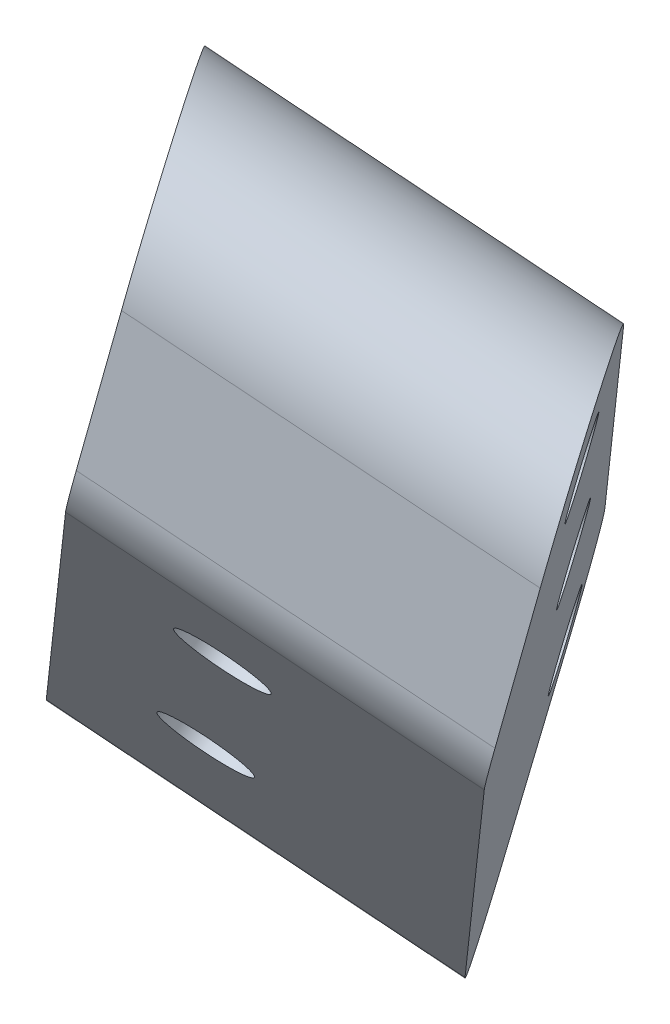
ISO-10303-21;
HEADER;
FILE_DESCRIPTION(('STEP AP214'),'2;1');
FILE_NAME('part.step','',(''),(''),'','','');
FILE_SCHEMA(('AUTOMOTIVE_DESIGN { 1 0 10303 214 1 1 1 1 }'));
ENDSEC;
DATA;
#1=APPLICATION_CONTEXT('core data for automotive mechanical design processes');
#2=APPLICATION_PROTOCOL_DEFINITION('international standard','automotive_design',2000,#1);
#3=PRODUCT_CONTEXT('',#1,'mechanical');
#4=PRODUCT('Part','Part','',(#3));
#5=PRODUCT_RELATED_PRODUCT_CATEGORY('part','',(#4));
#6=PRODUCT_DEFINITION_FORMATION('','',#4);
#7=PRODUCT_DEFINITION_CONTEXT('part definition',#1,'design');
#8=PRODUCT_DEFINITION('design','',#6,#7);
#9=PRODUCT_DEFINITION_SHAPE('','',#8);
#10=(LENGTH_UNIT() NAMED_UNIT(*) SI_UNIT(.MILLI.,.METRE.));
#11=(NAMED_UNIT(*) PLANE_ANGLE_UNIT() SI_UNIT($,.RADIAN.));
#12=(NAMED_UNIT(*) SI_UNIT($,.STERADIAN.) SOLID_ANGLE_UNIT());
#13=UNCERTAINTY_MEASURE_WITH_UNIT(LENGTH_MEASURE(1.E-05),#10,'distance_accuracy_value','');
#14=(GEOMETRIC_REPRESENTATION_CONTEXT(3) GLOBAL_UNCERTAINTY_ASSIGNED_CONTEXT((#13)) GLOBAL_UNIT_ASSIGNED_CONTEXT((#10,
#11,#12)) REPRESENTATION_CONTEXT('',''));
#15=CARTESIAN_POINT('',(0.,0.,0.));
#16=DIRECTION('',(0.,0.,1.));
#17=DIRECTION('',(1.,0.,0.));
#18=AXIS2_PLACEMENT_3D('',#15,#16,#17);
#19=CARTESIAN_POINT('',(185.976617276051,-86.2944774117005,110.115625331881));
#20=DIRECTION('',(-0.525823202782472,-0.503496874959795,-0.685566084576319));
#21=DIRECTION('',(0.84192618120736,-0.422850574318319,-0.335197997005144));
#22=AXIS2_PLACEMENT_3D('',#19,#20,#21);
#23=PLANE('',#22);
#24=DIRECTION('',(0.12292222881103,-0.842504955736532,0.52447642961673));
#25=VECTOR('',#24,1.);
#26=CARTESIAN_POINT('',(185.976617276051,-86.2944774117005,110.115625331881));
#27=LINE('',#26,#25);
#28=CARTESIAN_POINT('',(187.202208795844,-94.6946418011882,115.344898106117));
#29=VERTEX_POINT('',#28);
#30=CARTESIAN_POINT('',(188.014618086983,-100.262868642591,118.811232295833));
#31=VERTEX_POINT('',#30);
#32=EDGE_CURVE('E105',#29,#31,#27,.T.);
#33=ORIENTED_EDGE('',*,*,#32,.F.);
#34=DIRECTION('',(0.841926181207359,-0.422850574318319,-0.335197997005144));
#35=VECTOR('',#34,1.);
#36=CARTESIAN_POINT('',(184.818690380374,-93.4975390701214,116.293853746794));
#37=LINE('',#36,#35);
#38=CARTESIAN_POINT('',(199.832260071021,-101.03798229182,110.316466892068));
#39=VERTEX_POINT('',#38);
#40=EDGE_CURVE('E157',#29,#39,#37,.T.);
#41=ORIENTED_EDGE('',*,*,#40,.T.);
#42=DIRECTION('',(-0.122922228811031,0.842504955736533,-0.524476429616729));
#43=VECTOR('',#42,1.);
#44=CARTESIAN_POINT('',(201.275744144693,-110.931575154228,116.475429192796));
#45=LINE('',#44,#43);
#46=CARTESIAN_POINT('',(200.644669362159,-106.606209133222,113.782801081784));
#47=VERTEX_POINT('',#46);
#48=EDGE_CURVE('E124',#47,#39,#45,.T.);
#49=ORIENTED_EDGE('',*,*,#48,.F.);
#50=DIRECTION('',(0.841926181207359,-0.422850574318319,-0.335197997005144));
#51=VECTOR('',#50,1.);
#52=CARTESIAN_POINT('',(184.051134018149,-98.272241017251,120.389223277334));
#53=LINE('',#52,#51);
#54=EDGE_CURVE('E122',#47,#31,#53,.F.);
#55=ORIENTED_EDGE('',*,*,#54,.T.);
#56=EDGE_LOOP('',(#33,#41,#49,#55));
#57=FACE_BOUND('',#56,.T.);
#58=ADVANCED_FACE('F41',(#57),#23,.T.);
#59=CARTESIAN_POINT('',(213.598784000708,-71.3473521679495,145.102749077753));
#60=DIRECTION('',(0.404198114358015,0.0826871389079361,0.910926298560232));
#61=DIRECTION('',(-0.84192618120736,0.422850574318318,0.335197997005144));
#62=AXIS2_PLACEMENT_3D('',#59,#60,#61);
#63=PLANE('',#62);
#64=DIRECTION('',(-0.158999682000957,-0.97439119569462,0.158999682000952));
#65=VECTOR('',#64,1.);
#66=CARTESIAN_POINT('',(226.765173325175,-74.4038743041625,139.537979814407));
#67=LINE('',#66,#65);
#68=CARTESIAN_POINT('',(227.396164309813,-70.5369982685889,138.90698882977));
#69=VERTEX_POINT('',#68);
#70=CARTESIAN_POINT('',(226.442486068137,-76.381385317167,139.860667071446));
#71=VERTEX_POINT('',#70);
#72=EDGE_CURVE('E190',#69,#71,#67,.T.);
#73=ORIENTED_EDGE('',*,*,#72,.F.);
#74=DIRECTION('',(-0.841926181207359,0.422850574318319,0.335197997005144));
#75=VECTOR('',#74,1.);
#76=CARTESIAN_POINT('',(216.156009019091,-64.8917217274877,143.382057575196));
#77=LINE('',#76,#75);
#78=CARTESIAN_POINT('',(214.766113034639,-64.1936577779554,143.935420043822));
#79=VERTEX_POINT('',#78);
#80=EDGE_CURVE('E11',#69,#79,#77,.T.);
#81=ORIENTED_EDGE('',*,*,#80,.T.);
#82=DIRECTION('',(0.158999682000957,0.97439119569462,-0.158999682000953));
#83=VECTOR('',#82,1.);
#84=CARTESIAN_POINT('',(213.598784000708,-71.3473521679495,145.102749077753));
#85=LINE('',#84,#83);
#86=CARTESIAN_POINT('',(213.812434792963,-70.0380448265335,144.889098285497));
#87=VERTEX_POINT('',#86);
#88=EDGE_CURVE('E197',#87,#79,#85,.T.);
#89=ORIENTED_EDGE('',*,*,#88,.F.);
#90=DIRECTION('',(0.841926181207359,-0.422850574318319,-0.335197997005144));
#91=VECTOR('',#90,1.);
#92=CARTESIAN_POINT('',(214.066820976806,-70.1658082175974,144.787818932042));
#93=LINE('',#92,#91);
#94=EDGE_CURVE('E140',#87,#71,#93,.T.);
#95=ORIENTED_EDGE('',*,*,#94,.T.);
#96=EDGE_LOOP('',(#73,#81,#89,#95));
#97=FACE_BOUND('',#96,.T.);
#98=ADVANCED_FACE('F235',(#97),#63,.T.);
#99=CARTESIAN_POINT('',(88.6800986061576,-24.2076389183273,-59.6705769029359));
#100=DIRECTION('',(0.809172566386445,-0.220885605875267,-0.544471585048009));
#101=DIRECTION('',(0.558260781142676,0.,0.829665535163399));
#102=AXIS2_PLACEMENT_3D('',#99,#100,#101);
#103=PLANE('',#102);
#104=CARTESIAN_POINT('',(190.488893618727,-95.0744781125999,120.383536746134));
#105=DIRECTION('',(0.809172566386444,-0.220885605875265,-0.54447158504801));
#106=DIRECTION('',(-0.558260781142677,0.,-0.829665535163398));
#107=AXIS2_PLACEMENT_3D('',#104,#105,#106);
#108=CIRCLE('',#107,1.75000000000021);
#109=CARTESIAN_POINT('',(189.511937251727,-95.0744781125999,118.931622059598));
#110=VERTEX_POINT('',#109);
#111=EDGE_CURVE('E118',#110,#110,#108,.T.);
#112=ORIENTED_EDGE('',*,*,#111,.T.);
#113=EDGE_LOOP('',(#112));
#114=FACE_BOUND('',#113,.T.);
#115=CARTESIAN_POINT('',(201.068795197788,-81.5306176833387,130.6123943192));
#116=DIRECTION('',(0.809172566386444,-0.220885605875265,-0.54447158504801));
#117=DIRECTION('',(-0.558260781142677,0.,-0.829665535163398));
#118=AXIS2_PLACEMENT_3D('',#115,#116,#117);
#119=CIRCLE('',#118,1.75000000000027);
#120=CARTESIAN_POINT('',(200.091838830788,-81.5306176833387,129.160479632664));
#121=VERTEX_POINT('',#120);
#122=EDGE_CURVE('E364',#121,#121,#119,.T.);
#123=ORIENTED_EDGE('',*,*,#122,.T.);
#124=EDGE_LOOP('',(#123));
#125=FACE_BOUND('',#124,.T.);
#126=CARTESIAN_POINT('',(211.648696776849,-67.9867572540774,140.841251892266));
#127=DIRECTION('',(0.809172566386444,-0.220885605875265,-0.54447158504801));
#128=DIRECTION('',(-0.558260781142677,0.,-0.829665535163398));
#129=AXIS2_PLACEMENT_3D('',#126,#127,#128);
#130=CIRCLE('',#129,1.75000000000024);
#131=CARTESIAN_POINT('',(210.671740409849,-67.9867572540774,139.38933720573));
#132=VERTEX_POINT('',#131);
#133=EDGE_CURVE('E205',#132,#132,#130,.T.);
#134=ORIENTED_EDGE('',*,*,#133,.T.);
#135=EDGE_LOOP('',(#134));
#136=FACE_BOUND('',#135,.T.);
#137=DIRECTION('',(0.527989065999957,0.679937623467727,0.508834329008521));
#138=VECTOR('',#137,1.);
#139=CARTESIAN_POINT('',(137.008875950495,-155.279449206516,65.3280435791776));
#140=LINE('',#139,#138);
#141=CARTESIAN_POINT('',(188.755013198871,-88.6414298799968,115.196900192133));
#142=VERTEX_POINT('',#141);
#143=CARTESIAN_POINT('',(210.586127898886,-60.5275972219907,136.23601125564));
#144=VERTEX_POINT('',#143);
#145=EDGE_CURVE('E179',#142,#144,#140,.T.);
#146=ORIENTED_EDGE('',*,*,#145,.F.);
#147=CARTESIAN_POINT('',(190.090827290536,-92.3074904359615,118.669412212537));
#148=DIRECTION('',(0.809172566386445,-0.220885605875267,-0.544471585048009));
#149=DIRECTION('',(0.232829945707228,-0.730253036622379,0.642277758361415));
#150=AXIS2_PLACEMENT_3D('',#147,#148,#149);
#151=ELLIPSE('',#150,5.22372722873458,5.);
#152=EDGE_CURVE('E50',#142,#29,#151,.F.);
#153=ORIENTED_EDGE('',*,*,#152,.T.);
#154=ORIENTED_EDGE('',*,*,#32,.T.);
#155=CARTESIAN_POINT('',(189.747789183798,-98.8305778234545,120.805940759685));
#156=DIRECTION('',(0.809172566386445,-0.220885605875267,-0.544471585048009));
#157=DIRECTION('',(0.232829945707228,-0.730253036622379,0.642277758361415));
#158=AXIS2_PLACEMENT_3D('',#155,#156,#157);
#159=ELLIPSE('',#158,3.13423633724075,3.);
#160=CARTESIAN_POINT('',(190.549277638797,-101.030214157033,122.889447971927));
#161=VERTEX_POINT('',#160);
#162=EDGE_CURVE('E110',#31,#161,#159,.F.);
#163=ORIENTED_EDGE('',*,*,#162,.T.);
#164=DIRECTION('',(0.527989065999957,0.679937623467728,0.508834329008521));
#165=VECTOR('',#164,1.);
#166=CARTESIAN_POINT('',(188.509775218846,-103.656659509367,120.923935971406));
#167=LINE('',#166,#165);
#168=CARTESIAN_POINT('',(212.907420621509,-72.2376811601123,144.436467437073));
#169=VERTEX_POINT('',#168);
#170=EDGE_CURVE('E117',#161,#169,#167,.T.);
#171=ORIENTED_EDGE('',*,*,#170,.T.);
#172=CARTESIAN_POINT('',(212.10593216651,-70.0380448265335,142.352960224831));
#173=DIRECTION('',(0.809172566386445,-0.220885605875267,-0.544471585048009));
#174=DIRECTION('',(0.232829945707228,-0.730253036622379,0.642277758361415));
#175=AXIS2_PLACEMENT_3D('',#172,#173,#174);
#176=ELLIPSE('',#175,3.13423633724075,3.);
#177=EDGE_CURVE('E135',#169,#87,#176,.F.);
#178=ORIENTED_EDGE('',*,*,#177,.T.);
#179=ORIENTED_EDGE('',*,*,#88,.T.);
#180=CARTESIAN_POINT('',(211.921941990551,-64.1936577779554,139.708523276044));
#181=DIRECTION('',(0.809172566386445,-0.220885605875267,-0.544471585048009));
#182=DIRECTION('',(-0.232829945707228,0.730253036622379,-0.642277758361415));
#183=AXIS2_PLACEMENT_3D('',#180,#181,#182);
#184=ELLIPSE('',#183,5.22372722873458,5.);
#185=EDGE_CURVE('E57',#79,#144,#184,.F.);
#186=ORIENTED_EDGE('',*,*,#185,.T.);
#187=EDGE_LOOP('',(#146,#153,#154,#163,#171,#178,#179,#186));
#188=FACE_BOUND('',#187,.T.);
#189=ADVANCED_FACE('F107',(#114,#125,#136,#188),#103,.F.);
#190=CARTESIAN_POINT('',(211.253028266815,-11.6412960040825,46.2298565024584));
#191=DIRECTION('',(0.0127540111486141,-0.605437357739748,0.7957907646189));
#192=DIRECTION('',(-0.932864874414854,-0.293736319493059,-0.208523621428438));
#193=AXIS2_PLACEMENT_3D('',#190,#191,#192);
#194=CYLINDRICAL_SURFACE('',#193,1.74999999999995);
#195=CARTESIAN_POINT('',(212.717958189311,-81.1820303828364,137.634645909617));
#196=DIRECTION('',(-0.0127540111486141,0.605437357739748,-0.7957907646189));
#197=DIRECTION('',(-0.932864874414854,-0.293736319493059,-0.208523621428438));
#198=AXIS2_PLACEMENT_3D('',#195,#196,#197);
#199=CIRCLE('',#198,1.74999999999995);
#200=CARTESIAN_POINT('',(211.085444659085,-81.6960689419492,137.269729572117));
#201=VERTEX_POINT('',#200);
#202=EDGE_CURVE('E206',#201,#201,#199,.T.);
#203=ORIENTED_EDGE('',*,*,#202,.F.);
#204=EDGE_LOOP('',(#203));
#205=FACE_BOUND('',#204,.T.);
#206=CARTESIAN_POINT('',(212.543927470561,-72.9207314630371,126.775941371338));
#207=DIRECTION('',(-0.0127540111486136,0.605437357739749,-0.7957907646189));
#208=DIRECTION('',(0.,0.79585549608909,0.605486605421448));
#209=AXIS2_PLACEMENT_3D('',#206,#207,#208);
#210=CIRCLE('',#209,1.74999999999995);
#211=CARTESIAN_POINT('',(212.543927470561,-71.5279843448812,127.835542930826));
#212=VERTEX_POINT('',#211);
#213=EDGE_CURVE('E377',#212,#212,#210,.F.);
#214=ORIENTED_EDGE('',*,*,#213,.F.);
#215=EDGE_LOOP('',(#214));
#216=FACE_BOUND('',#215,.T.);
#217=ADVANCED_FACE('F244',(#205,#216),#194,.F.);
#218=CARTESIAN_POINT('',(200.46418883716,-25.1267399738119,36.1430460699975));
#219=DIRECTION('',(0.0127540111486141,-0.605437357739748,0.7957907646189));
#220=DIRECTION('',(-0.932864874414854,-0.293736319493059,-0.208523621428438));
#221=AXIS2_PLACEMENT_3D('',#218,#219,#220);
#222=CYLINDRICAL_SURFACE('',#221,1.7499999999999);
#223=CARTESIAN_POINT('',(201.929118759655,-94.6674743525658,127.547835477156));
#224=DIRECTION('',(-0.0127540111486141,0.605437357739748,-0.7957907646189));
#225=DIRECTION('',(-0.932864874414854,-0.293736319493059,-0.208523621428438));
#226=AXIS2_PLACEMENT_3D('',#223,#224,#225);
#227=CIRCLE('',#226,1.7499999999999);
#228=CARTESIAN_POINT('',(200.296605229429,-95.1815129116786,127.182919139657));
#229=VERTEX_POINT('',#228);
#230=EDGE_CURVE('E373',#229,#229,#227,.T.);
#231=ORIENTED_EDGE('',*,*,#230,.F.);
#232=EDGE_LOOP('',(#231));
#233=FACE_BOUND('',#232,.T.);
#234=CARTESIAN_POINT('',(201.755088040906,-86.4061754327664,116.689130938877));
#235=DIRECTION('',(-0.0127540111486136,0.605437357739749,-0.7957907646189));
#236=DIRECTION('',(0.,0.79585549608909,0.605486605421448));
#237=AXIS2_PLACEMENT_3D('',#234,#235,#236);
#238=CIRCLE('',#237,1.7499999999999);
#239=CARTESIAN_POINT('',(201.755088040906,-85.0134283146106,117.748732498365));
#240=VERTEX_POINT('',#239);
#241=EDGE_CURVE('E182',#240,#240,#238,.F.);
#242=ORIENTED_EDGE('',*,*,#241,.F.);
#243=EDGE_LOOP('',(#242));
#244=FACE_BOUND('',#243,.T.);
#245=ADVANCED_FACE('F247',(#233,#244),#222,.F.);
#246=CARTESIAN_POINT('',(231.07971496456,-47.9632466628545,135.223438175022));
#247=DIRECTION('',(0.809172566386446,-0.220885605875289,-0.544471585047998));
#248=DIRECTION('',(-0.558260781142668,0.,-0.829665535163404));
#249=AXIS2_PLACEMENT_3D('',#246,#247,#248);
#250=PLANE('',#249);
#251=CARTESIAN_POINT('',(223.267509790784,-71.1584274993941,133.023248908892));
#252=DIRECTION('',(0.809172566386446,-0.220885605875289,-0.544471585047998));
#253=DIRECTION('',(-0.558260781142668,0.,-0.829665535163404));
#254=AXIS2_PLACEMENT_3D('',#251,#252,#253);
#255=CIRCLE('',#254,1.75000000000024);
#256=CARTESIAN_POINT('',(222.290553423784,-71.1584274993941,131.571334222356));
#257=VERTEX_POINT('',#256);
#258=EDGE_CURVE('E189',#257,#257,#255,.F.);
#259=ORIENTED_EDGE('',*,*,#258,.T.);
#260=EDGE_LOOP('',(#259));
#261=FACE_BOUND('',#260,.T.);
#262=CARTESIAN_POINT('',(212.687608211723,-84.7022879286554,122.794391335826));
#263=DIRECTION('',(0.809172566386446,-0.220885605875289,-0.544471585047998));
#264=DIRECTION('',(-0.558260781142668,0.,-0.829665535163404));
#265=AXIS2_PLACEMENT_3D('',#262,#263,#264);
#266=CIRCLE('',#265,1.75000000000027);
#267=CARTESIAN_POINT('',(211.710651844723,-84.7022879286554,121.34247664929));
#268=VERTEX_POINT('',#267);
#269=EDGE_CURVE('E195',#268,#268,#266,.F.);
#270=ORIENTED_EDGE('',*,*,#269,.T.);
#271=EDGE_LOOP('',(#270));
#272=FACE_BOUND('',#271,.T.);
#273=CARTESIAN_POINT('',(202.107706632661,-98.2461483579165,112.56553376276));
#274=DIRECTION('',(0.809172566386446,-0.220885605875289,-0.544471585047998));
#275=DIRECTION('',(-0.558260781142668,0.,-0.829665535163404));
#276=AXIS2_PLACEMENT_3D('',#273,#274,#275);
#277=CIRCLE('',#276,1.75000000000021);
#278=CARTESIAN_POINT('',(201.130750265662,-98.2461483579165,111.113619076224));
#279=VERTEX_POINT('',#278);
#280=EDGE_CURVE('E128',#279,#279,#277,.F.);
#281=ORIENTED_EDGE('',*,*,#280,.T.);
#282=EDGE_LOOP('',(#281));
#283=FACE_BOUND('',#282,.T.);
#284=ORIENTED_EDGE('',*,*,#48,.T.);
#285=CARTESIAN_POINT('',(202.72087856571,-98.650830926595,113.640980998485));
#286=DIRECTION('',(0.809172566386446,-0.220885605875289,-0.544471585047998));
#287=DIRECTION('',(0.232829945707224,-0.730253036622356,0.642277758361442));
#288=AXIS2_PLACEMENT_3D('',#285,#286,#287);
#289=ELLIPSE('',#288,5.22372722873454,5.);
#290=CARTESIAN_POINT('',(201.385064474045,-94.9847703706304,110.168468978082));
#291=VERTEX_POINT('',#290);
#292=EDGE_CURVE('E163',#39,#291,#289,.T.);
#293=ORIENTED_EDGE('',*,*,#292,.T.);
#294=DIRECTION('',(0.527989065999966,0.679937623467723,0.508834329008518));
#295=VECTOR('',#294,1.);
#296=CARTESIAN_POINT('',(233.27506672546,-53.9172298863566,140.901544609007));
#297=LINE('',#296,#295);
#298=CARTESIAN_POINT('',(223.21617917406,-66.8709377126244,131.207580041588));
#299=VERTEX_POINT('',#298);
#300=EDGE_CURVE('E153',#291,#299,#297,.T.);
#301=ORIENTED_EDGE('',*,*,#300,.T.);
#302=CARTESIAN_POINT('',(224.551993265725,-70.536998268589,134.680092061992));
#303=DIRECTION('',(0.809172566386446,-0.220885605875289,-0.544471585047998));
#304=DIRECTION('',(-0.232829945707224,0.730253036622356,-0.642277758361442));
#305=AXIS2_PLACEMENT_3D('',#302,#303,#304);
#306=ELLIPSE('',#305,5.22372722873454,5.);
#307=EDGE_CURVE('E160',#299,#69,#306,.T.);
#308=ORIENTED_EDGE('',*,*,#307,.T.);
#309=ORIENTED_EDGE('',*,*,#72,.T.);
#310=CARTESIAN_POINT('',(224.735983441684,-76.381385317167,137.324529010779));
#311=DIRECTION('',(0.809172566386446,-0.220885605875289,-0.544471585047998));
#312=DIRECTION('',(0.232829945707224,-0.730253036622356,0.642277758361443));
#313=AXIS2_PLACEMENT_3D('',#310,#311,#312);
#314=ELLIPSE('',#313,3.13423633724073,3.);
#315=CARTESIAN_POINT('',(225.537471896683,-78.5810216507458,139.408036223021));
#316=VERTEX_POINT('',#315);
#317=EDGE_CURVE('E136',#71,#316,#314,.T.);
#318=ORIENTED_EDGE('',*,*,#317,.T.);
#319=DIRECTION('',(0.527989065999957,0.679937623467728,0.508834329008521));
#320=VECTOR('',#319,1.);
#321=CARTESIAN_POINT('',(200.999083351563,-110.181247234012,115.759867587825));
#322=LINE('',#321,#320);
#323=CARTESIAN_POINT('',(203.179328913971,-107.373554647667,117.861016757875));
#324=VERTEX_POINT('',#323);
#325=EDGE_CURVE('E201',#324,#316,#322,.T.);
#326=ORIENTED_EDGE('',*,*,#325,.F.);
#327=CARTESIAN_POINT('',(202.377840458971,-105.173918314088,115.777509545633));
#328=DIRECTION('',(0.809172566386446,-0.220885605875289,-0.544471585047998));
#329=DIRECTION('',(0.232829945707224,-0.730253036622356,0.642277758361443));
#330=AXIS2_PLACEMENT_3D('',#327,#328,#329);
#331=ELLIPSE('',#330,3.13423633724073,3.);
#332=EDGE_CURVE('E127',#324,#47,#331,.T.);
#333=ORIENTED_EDGE('',*,*,#332,.T.);
#334=EDGE_LOOP('',(#284,#293,#301,#308,#309,#318,#326,#333));
#335=FACE_BOUND('',#334,.T.);
#336=ADVANCED_FACE('F186',(#261,#272,#283,#335),#250,.T.);
#337=CARTESIAN_POINT('',(151.746289103061,-84.4986330739515,146.452447341724));
#338=DIRECTION('',(0.809172566386445,-0.220885605875266,-0.544471585048008));
#339=DIRECTION('',(-0.558260781142675,0.,-0.8296655351634));
#340=AXIS2_PLACEMENT_3D('',#337,#338,#339);
#341=CYLINDRICAL_SURFACE('',#340,1.75000000000021);
#342=ORIENTED_EDGE('',*,*,#111,.F.);
#343=EDGE_LOOP('',(#342));
#344=FACE_BOUND('',#343,.T.);
#345=ORIENTED_EDGE('',*,*,#280,.F.);
#346=EDGE_LOOP('',(#345));
#347=FACE_BOUND('',#346,.T.);
#348=ADVANCED_FACE('F220',(#344,#347),#341,.F.);
#349=CARTESIAN_POINT('',(162.326190682123,-70.9547726446903,156.68130491479));
#350=DIRECTION('',(0.809172566386445,-0.220885605875266,-0.544471585048008));
#351=DIRECTION('',(-0.558260781142675,0.,-0.8296655351634));
#352=AXIS2_PLACEMENT_3D('',#349,#350,#351);
#353=CYLINDRICAL_SURFACE('',#352,1.75000000000027);
#354=ORIENTED_EDGE('',*,*,#122,.F.);
#355=EDGE_LOOP('',(#354));
#356=FACE_BOUND('',#355,.T.);
#357=ORIENTED_EDGE('',*,*,#269,.F.);
#358=EDGE_LOOP('',(#357));
#359=FACE_BOUND('',#358,.T.);
#360=ADVANCED_FACE('F217',(#356,#359),#353,.F.);
#361=CARTESIAN_POINT('',(172.906092261184,-57.410912215429,166.910162487856));
#362=DIRECTION('',(0.809172566386445,-0.220885605875266,-0.544471585048008));
#363=DIRECTION('',(-0.558260781142675,0.,-0.8296655351634));
#364=AXIS2_PLACEMENT_3D('',#361,#362,#363);
#365=CYLINDRICAL_SURFACE('',#364,1.75000000000024);
#366=ORIENTED_EDGE('',*,*,#133,.F.);
#367=EDGE_LOOP('',(#366));
#368=FACE_BOUND('',#367,.T.);
#369=ORIENTED_EDGE('',*,*,#258,.F.);
#370=EDGE_LOOP('',(#369));
#371=FACE_BOUND('',#370,.T.);
#372=ADVANCED_FACE('F219',(#368,#371),#365,.F.);
#373=CARTESIAN_POINT('',(188.509775218846,-103.656659509367,120.923935971406));
#374=DIRECTION('',(0.0127540111486137,-0.605437357739748,0.7957907646189));
#375=DIRECTION('',(-0.0627971784749103,0.79379948451738,0.604928832802283));
#376=AXIS2_PLACEMENT_3D('',#373,#374,#375);
#377=PLANE('',#376);
#378=ORIENTED_EDGE('',*,*,#230,.T.);
#379=EDGE_LOOP('',(#378));
#380=FACE_BOUND('',#379,.T.);
#381=ORIENTED_EDGE('',*,*,#202,.T.);
#382=EDGE_LOOP('',(#381));
#383=FACE_BOUND('',#382,.T.);
#384=ORIENTED_EDGE('',*,*,#325,.T.);
#385=DIRECTION('',(0.841926181207359,-0.422850574318319,-0.335197997005144));
#386=VECTOR('',#385,1.);
#387=CARTESIAN_POINT('',(213.434357016928,-72.5023306773805,144.226677044238));
#388=LINE('',#387,#386);
#389=EDGE_CURVE('E150',#316,#169,#388,.F.);
#390=ORIENTED_EDGE('',*,*,#389,.T.);
#391=ORIENTED_EDGE('',*,*,#170,.F.);
#392=DIRECTION('',(0.841926181207359,-0.422850574318319,-0.335197997005144));
#393=VECTOR('',#392,1.);
#394=CARTESIAN_POINT('',(190.593326481867,-101.052337330069,122.871910705244));
#395=LINE('',#394,#393);
#396=EDGE_CURVE('E133',#161,#324,#395,.T.);
#397=ORIENTED_EDGE('',*,*,#396,.T.);
#398=EDGE_LOOP('',(#384,#390,#391,#397));
#399=FACE_BOUND('',#398,.T.);
#400=ADVANCED_FACE('F227',(#380,#383,#399),#377,.T.);
#401=CARTESIAN_POINT('',(212.854226633732,-70.4138696343212,142.055040036361));
#402=DIRECTION('',(0.841926181207359,-0.422850574318319,-0.335197997005144));
#403=DIRECTION('',(0.448815584795047,0.893624401437808,0.));
#404=AXIS2_PLACEMENT_3D('',#401,#402,#403);
#405=CYLINDRICAL_SURFACE('',#404,3.);
#406=ORIENTED_EDGE('',*,*,#177,.F.);
#407=ORIENTED_EDGE('',*,*,#389,.F.);
#408=ORIENTED_EDGE('',*,*,#317,.F.);
#409=ORIENTED_EDGE('',*,*,#94,.F.);
#410=EDGE_LOOP('',(#406,#407,#408,#409));
#411=FACE_BOUND('',#410,.T.);
#412=ADVANCED_FACE('F255',(#411),#405,.T.);
#413=CARTESIAN_POINT('',(190.555064448421,-99.2360252568498,120.484538411387));
#414=DIRECTION('',(0.841926181207359,-0.422850574318319,-0.335197997005144));
#415=DIRECTION('',(0.448815584795047,0.893624401437808,0.));
#416=AXIS2_PLACEMENT_3D('',#413,#414,#415);
#417=CYLINDRICAL_SURFACE('',#416,3.);
#418=ORIENTED_EDGE('',*,*,#162,.F.);
#419=ORIENTED_EDGE('',*,*,#54,.F.);
#420=ORIENTED_EDGE('',*,*,#332,.F.);
#421=ORIENTED_EDGE('',*,*,#396,.F.);
#422=EDGE_LOOP('',(#418,#419,#420,#421));
#423=FACE_BOUND('',#422,.T.);
#424=ADVANCED_FACE('F131',(#423),#417,.T.);
#425=CARTESIAN_POINT('',(1.88436492005069,-89.4514600088758,117.575575485613));
#426=DIRECTION('',(-0.0127540111486136,0.605437357739749,-0.7957907646189));
#427=DIRECTION('',(0.,0.79585549608909,0.605486605421448));
#428=AXIS2_PLACEMENT_3D('',#425,#426,#427);
#429=PLANE('',#428);
#430=ORIENTED_EDGE('',*,*,#300,.F.);
#431=DIRECTION('',(0.841926181207359,-0.422850574318319,-0.335197997005144));
#432=VECTOR('',#431,1.);
#433=CARTESIAN_POINT('',(55.9107672944744,-21.9214882397415,168.086483785977));
#434=LINE('',#433,#432);
#435=EDGE_CURVE('E169',#291,#142,#434,.F.);
#436=ORIENTED_EDGE('',*,*,#435,.T.);
#437=ORIENTED_EDGE('',*,*,#145,.T.);
#438=DIRECTION('',(-0.841926181207359,0.422850574318319,0.335197997005144));
#439=VECTOR('',#438,1.);
#440=CARTESIAN_POINT('',(78.2133868753148,5.95553492819176,188.937873532392));
#441=LINE('',#440,#439);
#442=EDGE_CURVE('E166',#144,#299,#441,.F.);
#443=ORIENTED_EDGE('',*,*,#442,.T.);
#444=EDGE_LOOP('',(#430,#436,#437,#443));
#445=FACE_BOUND('',#444,.T.);
#446=ORIENTED_EDGE('',*,*,#241,.T.);
#447=EDGE_LOOP('',(#446));
#448=FACE_BOUND('',#447,.T.);
#449=ORIENTED_EDGE('',*,*,#213,.T.);
#450=EDGE_LOOP('',(#449));
#451=FACE_BOUND('',#450,.T.);
#452=ADVANCED_FACE('F177',(#445,#448,#451),#429,.T.);
#453=CARTESIAN_POINT('',(187.447806394286,-90.9800546953224,119.721684169676));
#454=DIRECTION('',(0.841926181207359,-0.422850574318319,-0.335197997005144));
#455=DIRECTION('',(0.448815584795047,0.893624401437808,0.));
#456=AXIS2_PLACEMENT_3D('',#453,#454,#455);
#457=CYLINDRICAL_SURFACE('',#456,5.);
#458=ORIENTED_EDGE('',*,*,#152,.F.);
#459=ORIENTED_EDGE('',*,*,#435,.F.);
#460=ORIENTED_EDGE('',*,*,#292,.F.);
#461=ORIENTED_EDGE('',*,*,#40,.F.);
#462=EDGE_LOOP('',(#458,#459,#460,#461));
#463=FACE_BOUND('',#462,.T.);
#464=ADVANCED_FACE('F184',(#463),#457,.T.);
#465=CARTESIAN_POINT('',(214.135018447301,-65.3051574220274,138.827426082394));
#466=DIRECTION('',(-0.841926181207359,0.422850574318319,0.335197997005144));
#467=DIRECTION('',(-0.448815584795047,-0.893624401437808,0.));
#468=AXIS2_PLACEMENT_3D('',#465,#466,#467);
#469=CYLINDRICAL_SURFACE('',#468,5.);
#470=ORIENTED_EDGE('',*,*,#307,.F.);
#471=ORIENTED_EDGE('',*,*,#442,.F.);
#472=ORIENTED_EDGE('',*,*,#185,.F.);
#473=ORIENTED_EDGE('',*,*,#80,.F.);
#474=EDGE_LOOP('',(#470,#471,#472,#473));
#475=FACE_BOUND('',#474,.T.);
#476=ADVANCED_FACE('F43',(#475),#469,.T.);
#477=CLOSED_SHELL('',(#58,#98,#189,#217,#245,#336,#348,#360,#372,#400,#412,#424,#452,#464,#476));
#478=MANIFOLD_SOLID_BREP('B2',#477);
#479=ADVANCED_BREP_SHAPE_REPRESENTATION('',(#18,#478),#14);
#480=SHAPE_DEFINITION_REPRESENTATION(#9,#479);
ENDSEC;
END-ISO-10303-21;
